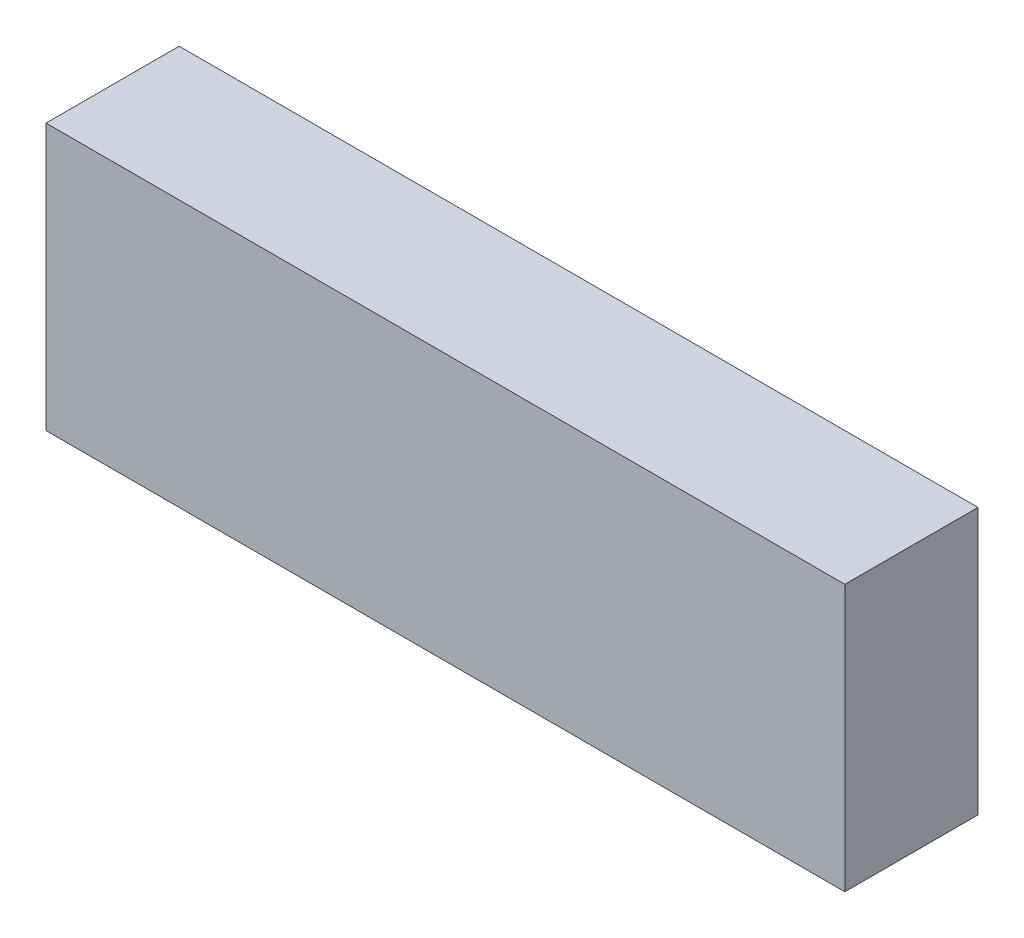
ISO-10303-21;
HEADER;
FILE_DESCRIPTION(('STEP AP214'),'2;1');
FILE_NAME('part.step','',(''),(''),'','','');
FILE_SCHEMA(('AUTOMOTIVE_DESIGN { 1 0 10303 214 1 1 1 1 }'));
ENDSEC;
DATA;
#1=APPLICATION_CONTEXT('core data for automotive mechanical design processes');
#2=APPLICATION_PROTOCOL_DEFINITION('international standard','automotive_design',2000,#1);
#3=PRODUCT_CONTEXT('',#1,'mechanical');
#4=PRODUCT('Part','Part','',(#3));
#5=PRODUCT_RELATED_PRODUCT_CATEGORY('part','',(#4));
#6=PRODUCT_DEFINITION_FORMATION('','',#4);
#7=PRODUCT_DEFINITION_CONTEXT('part definition',#1,'design');
#8=PRODUCT_DEFINITION('design','',#6,#7);
#9=PRODUCT_DEFINITION_SHAPE('','',#8);
#10=(LENGTH_UNIT() NAMED_UNIT(*) SI_UNIT(.MILLI.,.METRE.));
#11=(NAMED_UNIT(*) PLANE_ANGLE_UNIT() SI_UNIT($,.RADIAN.));
#12=(NAMED_UNIT(*) SI_UNIT($,.STERADIAN.) SOLID_ANGLE_UNIT());
#13=UNCERTAINTY_MEASURE_WITH_UNIT(LENGTH_MEASURE(1.E-05),#10,'distance_accuracy_value','');
#14=(GEOMETRIC_REPRESENTATION_CONTEXT(3) GLOBAL_UNCERTAINTY_ASSIGNED_CONTEXT((#13)) GLOBAL_UNIT_ASSIGNED_CONTEXT((#10,
#11,#12)) REPRESENTATION_CONTEXT('',''));
#15=CARTESIAN_POINT('',(0.,0.,0.));
#16=DIRECTION('',(0.,0.,1.));
#17=DIRECTION('',(1.,0.,0.));
#18=AXIS2_PLACEMENT_3D('',#15,#16,#17);
#19=CARTESIAN_POINT('',(-1.975,-0.575,0.));
#20=DIRECTION('',(1.,0.,0.));
#21=DIRECTION('',(0.,0.,1.));
#22=AXIS2_PLACEMENT_3D('',#19,#20,#21);
#23=PLANE('',#22);
#24=DIRECTION('',(0.,1.,0.));
#25=VECTOR('',#24,1.);
#26=CARTESIAN_POINT('',(-1.975,-0.575,0.1));
#27=LINE('',#26,#25);
#28=CARTESIAN_POINT('',(-1.975,-0.575,0.1));
#29=VERTEX_POINT('',#28);
#30=CARTESIAN_POINT('',(-1.975,-0.375,0.1));
#31=VERTEX_POINT('',#30);
#32=EDGE_CURVE('E11',#29,#31,#27,.T.);
#33=ORIENTED_EDGE('',*,*,#32,.T.);
#34=DIRECTION('',(0.,0.,1.));
#35=VECTOR('',#34,1.);
#36=CARTESIAN_POINT('',(-1.975,-0.375,0.));
#37=LINE('',#36,#35);
#38=CARTESIAN_POINT('',(-1.975,-0.375,0.));
#39=VERTEX_POINT('',#38);
#40=EDGE_CURVE('E24',#39,#31,#37,.T.);
#41=ORIENTED_EDGE('',*,*,#40,.F.);
#42=DIRECTION('',(0.,1.,0.));
#43=VECTOR('',#42,1.);
#44=CARTESIAN_POINT('',(-1.975,-0.575,0.));
#45=LINE('',#44,#43);
#46=CARTESIAN_POINT('',(-1.975,-0.575,0.));
#47=VERTEX_POINT('',#46);
#48=EDGE_CURVE('E86',#47,#39,#45,.T.);
#49=ORIENTED_EDGE('',*,*,#48,.F.);
#50=DIRECTION('',(0.,0.,1.));
#51=VECTOR('',#50,1.);
#52=CARTESIAN_POINT('',(-1.975,-0.575,0.));
#53=LINE('',#52,#51);
#54=EDGE_CURVE('E36',#47,#29,#53,.T.);
#55=ORIENTED_EDGE('',*,*,#54,.T.);
#56=EDGE_LOOP('',(#33,#41,#49,#55));
#57=FACE_BOUND('',#56,.T.);
#58=ADVANCED_FACE('F17',(#57),#23,.F.);
#59=CARTESIAN_POINT('',(-1.375,-0.575,0.));
#60=DIRECTION('',(1.,0.,0.));
#61=DIRECTION('',(0.,0.,1.));
#62=AXIS2_PLACEMENT_3D('',#59,#60,#61);
#63=PLANE('',#62);
#64=DIRECTION('',(0.,0.,1.));
#65=VECTOR('',#64,1.);
#66=CARTESIAN_POINT('',(-1.375,-0.575,0.));
#67=LINE('',#66,#65);
#68=CARTESIAN_POINT('',(-1.375,-0.575,0.));
#69=VERTEX_POINT('',#68);
#70=CARTESIAN_POINT('',(-1.375,-0.575,0.1));
#71=VERTEX_POINT('',#70);
#72=EDGE_CURVE('E83',#69,#71,#67,.T.);
#73=ORIENTED_EDGE('',*,*,#72,.F.);
#74=DIRECTION('',(0.,1.,0.));
#75=VECTOR('',#74,1.);
#76=CARTESIAN_POINT('',(-1.375,-0.575,0.));
#77=LINE('',#76,#75);
#78=CARTESIAN_POINT('',(-1.375,-0.375,0.));
#79=VERTEX_POINT('',#78);
#80=EDGE_CURVE('E63',#69,#79,#77,.T.);
#81=ORIENTED_EDGE('',*,*,#80,.T.);
#82=DIRECTION('',(0.,0.,1.));
#83=VECTOR('',#82,1.);
#84=CARTESIAN_POINT('',(-1.375,-0.375,0.));
#85=LINE('',#84,#83);
#86=CARTESIAN_POINT('',(-1.375,-0.375,0.1));
#87=VERTEX_POINT('',#86);
#88=EDGE_CURVE('E57',#79,#87,#85,.T.);
#89=ORIENTED_EDGE('',*,*,#88,.T.);
#90=DIRECTION('',(0.,1.,0.));
#91=VECTOR('',#90,1.);
#92=CARTESIAN_POINT('',(-1.375,-0.575,0.1));
#93=LINE('',#92,#91);
#94=EDGE_CURVE('E60',#71,#87,#93,.T.);
#95=ORIENTED_EDGE('',*,*,#94,.F.);
#96=EDGE_LOOP('',(#73,#81,#89,#95));
#97=FACE_BOUND('',#96,.T.);
#98=ADVANCED_FACE('F59',(#97),#63,.T.);
#99=CARTESIAN_POINT('',(-1.975,-0.575,0.));
#100=DIRECTION('',(0.,1.,0.));
#101=DIRECTION('',(0.,0.,1.));
#102=AXIS2_PLACEMENT_3D('',#99,#100,#101);
#103=PLANE('',#102);
#104=ORIENTED_EDGE('',*,*,#72,.T.);
#105=DIRECTION('',(1.,0.,0.));
#106=VECTOR('',#105,1.);
#107=CARTESIAN_POINT('',(-1.975,-0.575,0.1));
#108=LINE('',#107,#106);
#109=EDGE_CURVE('E71',#29,#71,#108,.T.);
#110=ORIENTED_EDGE('',*,*,#109,.F.);
#111=ORIENTED_EDGE('',*,*,#54,.F.);
#112=DIRECTION('',(1.,0.,0.));
#113=VECTOR('',#112,1.);
#114=CARTESIAN_POINT('',(-1.975,-0.575,0.));
#115=LINE('',#114,#113);
#116=EDGE_CURVE('E76',#47,#69,#115,.T.);
#117=ORIENTED_EDGE('',*,*,#116,.T.);
#118=EDGE_LOOP('',(#104,#110,#111,#117));
#119=FACE_BOUND('',#118,.T.);
#120=ADVANCED_FACE('F91',(#119),#103,.F.);
#121=CARTESIAN_POINT('',(-1.975,-0.375,0.));
#122=DIRECTION('',(0.,1.,0.));
#123=DIRECTION('',(0.,0.,1.));
#124=AXIS2_PLACEMENT_3D('',#121,#122,#123);
#125=PLANE('',#124);
#126=DIRECTION('',(1.,0.,0.));
#127=VECTOR('',#126,1.);
#128=CARTESIAN_POINT('',(-1.975,-0.375,0.));
#129=LINE('',#128,#127);
#130=EDGE_CURVE('E74',#39,#79,#129,.T.);
#131=ORIENTED_EDGE('',*,*,#130,.F.);
#132=ORIENTED_EDGE('',*,*,#40,.T.);
#133=DIRECTION('',(1.,0.,0.));
#134=VECTOR('',#133,1.);
#135=CARTESIAN_POINT('',(-1.975,-0.375,0.1));
#136=LINE('',#135,#134);
#137=EDGE_CURVE('E69',#31,#87,#136,.T.);
#138=ORIENTED_EDGE('',*,*,#137,.T.);
#139=ORIENTED_EDGE('',*,*,#88,.F.);
#140=EDGE_LOOP('',(#131,#132,#138,#139));
#141=FACE_BOUND('',#140,.T.);
#142=ADVANCED_FACE('F73',(#141),#125,.T.);
#143=CARTESIAN_POINT('',(-1.975,-0.575,0.));
#144=DIRECTION('',(0.,0.,1.));
#145=DIRECTION('',(1.,0.,0.));
#146=AXIS2_PLACEMENT_3D('',#143,#144,#145);
#147=PLANE('',#146);
#148=ORIENTED_EDGE('',*,*,#130,.T.);
#149=ORIENTED_EDGE('',*,*,#80,.F.);
#150=ORIENTED_EDGE('',*,*,#116,.F.);
#151=ORIENTED_EDGE('',*,*,#48,.T.);
#152=EDGE_LOOP('',(#148,#149,#150,#151));
#153=FACE_BOUND('',#152,.T.);
#154=ADVANCED_FACE('F89',(#153),#147,.F.);
#155=CARTESIAN_POINT('',(-1.975,-0.575,0.1));
#156=DIRECTION('',(0.,0.,1.));
#157=DIRECTION('',(1.,0.,0.));
#158=AXIS2_PLACEMENT_3D('',#155,#156,#157);
#159=PLANE('',#158);
#160=ORIENTED_EDGE('',*,*,#32,.F.);
#161=ORIENTED_EDGE('',*,*,#109,.T.);
#162=ORIENTED_EDGE('',*,*,#94,.T.);
#163=ORIENTED_EDGE('',*,*,#137,.F.);
#164=EDGE_LOOP('',(#160,#161,#162,#163));
#165=FACE_BOUND('',#164,.T.);
#166=ADVANCED_FACE('F68',(#165),#159,.T.);
#167=CLOSED_SHELL('',(#58,#98,#120,#142,#154,#166));
#168=MANIFOLD_SOLID_BREP('B1',#167);
#169=ADVANCED_BREP_SHAPE_REPRESENTATION('',(#18,#168),#14);
#170=SHAPE_DEFINITION_REPRESENTATION(#9,#169);
ENDSEC;
END-ISO-10303-21;
